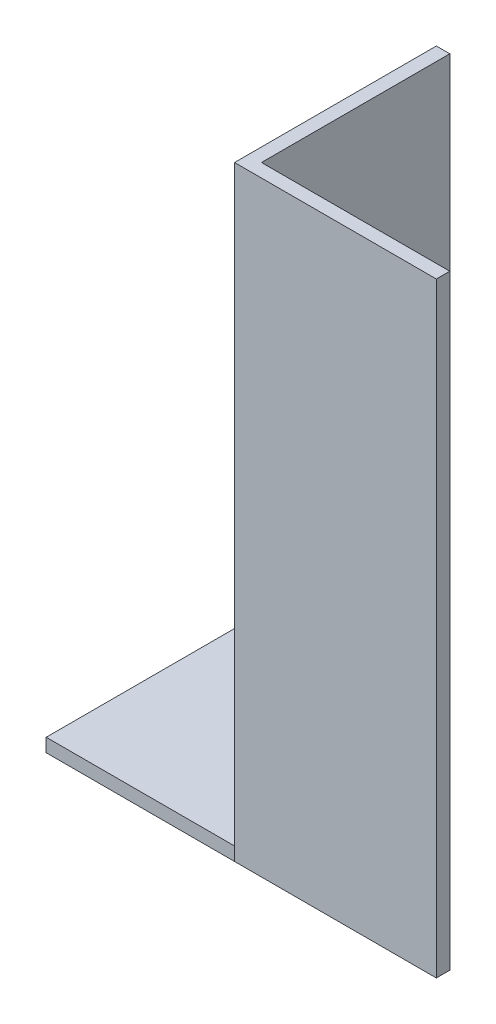
ISO-10303-21;
HEADER;
FILE_DESCRIPTION(('STEP AP214'),'2;1');
FILE_NAME('part.step','',(''),(''),'','','');
FILE_SCHEMA(('AUTOMOTIVE_DESIGN { 1 0 10303 214 1 1 1 1 }'));
ENDSEC;
DATA;
#1=APPLICATION_CONTEXT('core data for automotive mechanical design processes');
#2=APPLICATION_PROTOCOL_DEFINITION('international standard','automotive_design',2000,#1);
#3=PRODUCT_CONTEXT('',#1,'mechanical');
#4=PRODUCT('Part','Part','',(#3));
#5=PRODUCT_RELATED_PRODUCT_CATEGORY('part','',(#4));
#6=PRODUCT_DEFINITION_FORMATION('','',#4);
#7=PRODUCT_DEFINITION_CONTEXT('part definition',#1,'design');
#8=PRODUCT_DEFINITION('design','',#6,#7);
#9=PRODUCT_DEFINITION_SHAPE('','',#8);
#10=(LENGTH_UNIT() NAMED_UNIT(*) SI_UNIT(.MILLI.,.METRE.));
#11=(NAMED_UNIT(*) PLANE_ANGLE_UNIT() SI_UNIT($,.RADIAN.));
#12=(NAMED_UNIT(*) SI_UNIT($,.STERADIAN.) SOLID_ANGLE_UNIT());
#13=UNCERTAINTY_MEASURE_WITH_UNIT(LENGTH_MEASURE(1.E-05),#10,'distance_accuracy_value','');
#14=(GEOMETRIC_REPRESENTATION_CONTEXT(3) GLOBAL_UNCERTAINTY_ASSIGNED_CONTEXT((#13)) GLOBAL_UNIT_ASSIGNED_CONTEXT((#10,
#11,#12)) REPRESENTATION_CONTEXT('',''));
#15=CARTESIAN_POINT('',(0.,0.,0.));
#16=DIRECTION('',(0.,0.,1.));
#17=DIRECTION('',(1.,0.,0.));
#18=AXIS2_PLACEMENT_3D('',#15,#16,#17);
#19=CARTESIAN_POINT('',(15.,65.,0.));
#20=DIRECTION('',(0.,0.,-1.));
#21=DIRECTION('',(-1.,0.,0.));
#22=AXIS2_PLACEMENT_3D('',#19,#20,#21);
#23=PLANE('',#22);
#24=DIRECTION('',(-1.,0.,0.));
#25=VECTOR('',#24,1.);
#26=CARTESIAN_POINT('',(15.,20.,0.));
#27=LINE('',#26,#25);
#28=CARTESIAN_POINT('',(15.,20.,0.));
#29=VERTEX_POINT('',#28);
#30=CARTESIAN_POINT('',(0.,20.,0.));
#31=VERTEX_POINT('',#30);
#32=EDGE_CURVE('E105',#29,#31,#27,.T.);
#33=ORIENTED_EDGE('',*,*,#32,.F.);
#34=DIRECTION('',(0.,-1.,0.));
#35=VECTOR('',#34,1.);
#36=CARTESIAN_POINT('',(15.,65.,0.));
#37=LINE('',#36,#35);
#38=CARTESIAN_POINT('',(15.,65.,0.));
#39=VERTEX_POINT('',#38);
#40=EDGE_CURVE('E11',#39,#29,#37,.T.);
#41=ORIENTED_EDGE('',*,*,#40,.F.);
#42=DIRECTION('',(1.,0.,0.));
#43=VECTOR('',#42,1.);
#44=CARTESIAN_POINT('',(15.,65.,0.));
#45=LINE('',#44,#43);
#46=CARTESIAN_POINT('',(0.,65.,0.));
#47=VERTEX_POINT('',#46);
#48=EDGE_CURVE('E126',#47,#39,#45,.T.);
#49=ORIENTED_EDGE('',*,*,#48,.F.);
#50=DIRECTION('',(0.,-1.,0.));
#51=VECTOR('',#50,1.);
#52=CARTESIAN_POINT('',(0.,65.,0.));
#53=LINE('',#52,#51);
#54=EDGE_CURVE('E119',#47,#31,#53,.T.);
#55=ORIENTED_EDGE('',*,*,#54,.T.);
#56=EDGE_LOOP('',(#33,#41,#49,#55));
#57=FACE_BOUND('',#56,.T.);
#58=ADVANCED_FACE('F35',(#57),#23,.F.);
#59=CARTESIAN_POINT('',(15.,65.,-0.999999999999998));
#60=DIRECTION('',(-1.,0.,0.));
#61=DIRECTION('',(0.,0.,1.));
#62=AXIS2_PLACEMENT_3D('',#59,#60,#61);
#63=PLANE('',#62);
#64=DIRECTION('',(0.,0.,1.));
#65=VECTOR('',#64,1.);
#66=CARTESIAN_POINT('',(15.,20.,0.));
#67=LINE('',#66,#65);
#68=CARTESIAN_POINT('',(15.,20.,-0.999999999999993));
#69=VERTEX_POINT('',#68);
#70=EDGE_CURVE('E112',#69,#29,#67,.T.);
#71=ORIENTED_EDGE('',*,*,#70,.F.);
#72=DIRECTION('',(0.,-1.,0.));
#73=VECTOR('',#72,1.);
#74=CARTESIAN_POINT('',(15.,65.,-0.999999999999998));
#75=LINE('',#74,#73);
#76=CARTESIAN_POINT('',(15.,65.,-0.999999999999998));
#77=VERTEX_POINT('',#76);
#78=EDGE_CURVE('E42',#77,#69,#75,.T.);
#79=ORIENTED_EDGE('',*,*,#78,.F.);
#80=DIRECTION('',(0.,0.,-1.));
#81=VECTOR('',#80,1.);
#82=CARTESIAN_POINT('',(15.,65.,-0.999999999999998));
#83=LINE('',#82,#81);
#84=EDGE_CURVE('E147',#39,#77,#83,.T.);
#85=ORIENTED_EDGE('',*,*,#84,.F.);
#86=ORIENTED_EDGE('',*,*,#40,.T.);
#87=EDGE_LOOP('',(#71,#79,#85,#86));
#88=FACE_BOUND('',#87,.T.);
#89=ADVANCED_FACE('F146',(#88),#63,.F.);
#90=CARTESIAN_POINT('',(1.,65.,-0.999999999999997));
#91=DIRECTION('',(0.,0.,1.));
#92=DIRECTION('',(1.,0.,0.));
#93=AXIS2_PLACEMENT_3D('',#90,#91,#92);
#94=PLANE('',#93);
#95=DIRECTION('',(1.,0.,0.));
#96=VECTOR('',#95,1.);
#97=CARTESIAN_POINT('',(15.,20.,-0.999999999999993));
#98=LINE('',#97,#96);
#99=CARTESIAN_POINT('',(1.,20.,-0.999999999999996));
#100=VERTEX_POINT('',#99);
#101=EDGE_CURVE('E124',#100,#69,#98,.T.);
#102=ORIENTED_EDGE('',*,*,#101,.F.);
#103=DIRECTION('',(0.,-1.,0.));
#104=VECTOR('',#103,1.);
#105=CARTESIAN_POINT('',(1.,65.,-0.999999999999997));
#106=LINE('',#105,#104);
#107=CARTESIAN_POINT('',(1.,65.,-0.999999999999997));
#108=VERTEX_POINT('',#107);
#109=EDGE_CURVE('E135',#108,#100,#106,.T.);
#110=ORIENTED_EDGE('',*,*,#109,.F.);
#111=DIRECTION('',(-1.,0.,0.));
#112=VECTOR('',#111,1.);
#113=CARTESIAN_POINT('',(1.,65.,-0.999999999999997));
#114=LINE('',#113,#112);
#115=EDGE_CURVE('E144',#77,#108,#114,.T.);
#116=ORIENTED_EDGE('',*,*,#115,.F.);
#117=ORIENTED_EDGE('',*,*,#78,.T.);
#118=EDGE_LOOP('',(#102,#110,#116,#117));
#119=FACE_BOUND('',#118,.T.);
#120=ADVANCED_FACE('F142',(#119),#94,.F.);
#121=CARTESIAN_POINT('',(0.,65.,0.));
#122=DIRECTION('',(1.,0.,0.));
#123=DIRECTION('',(0.,0.,-1.));
#124=AXIS2_PLACEMENT_3D('',#121,#122,#123);
#125=PLANE('',#124);
#126=DIRECTION('',(0.,0.,-1.));
#127=VECTOR('',#126,1.);
#128=CARTESIAN_POINT('',(0.,20.,0.));
#129=LINE('',#128,#127);
#130=CARTESIAN_POINT('',(0.,20.,-0.999999999999996));
#131=VERTEX_POINT('',#130);
#132=EDGE_CURVE('E109',#31,#131,#129,.T.);
#133=ORIENTED_EDGE('',*,*,#132,.F.);
#134=ORIENTED_EDGE('',*,*,#54,.F.);
#135=DIRECTION('',(0.,0.,1.));
#136=VECTOR('',#135,1.);
#137=CARTESIAN_POINT('',(0.,65.,0.));
#138=LINE('',#137,#136);
#139=CARTESIAN_POINT('',(0.,65.,-15.));
#140=VERTEX_POINT('',#139);
#141=EDGE_CURVE('E49',#140,#47,#138,.T.);
#142=ORIENTED_EDGE('',*,*,#141,.F.);
#143=DIRECTION('',(0.,-1.,0.));
#144=VECTOR('',#143,1.);
#145=CARTESIAN_POINT('',(0.,65.,-15.));
#146=LINE('',#145,#144);
#147=CARTESIAN_POINT('',(0.,20.,-15.));
#148=VERTEX_POINT('',#147);
#149=EDGE_CURVE('E127',#140,#148,#146,.T.);
#150=ORIENTED_EDGE('',*,*,#149,.T.);
#151=DIRECTION('',(0.,0.,-1.));
#152=VECTOR('',#151,1.);
#153=CARTESIAN_POINT('',(0.,20.,-0.999999999999997));
#154=LINE('',#153,#152);
#155=EDGE_CURVE('E122',#131,#148,#154,.T.);
#156=ORIENTED_EDGE('',*,*,#155,.F.);
#157=EDGE_LOOP('',(#133,#134,#142,#150,#156));
#158=FACE_BOUND('',#157,.T.);
#159=ADVANCED_FACE('F118',(#158),#125,.F.);
#160=CARTESIAN_POINT('',(0.999999999999998,65.,-15.));
#161=DIRECTION('',(-1.,0.,0.));
#162=DIRECTION('',(0.,0.,1.));
#163=AXIS2_PLACEMENT_3D('',#160,#161,#162);
#164=PLANE('',#163);
#165=ORIENTED_EDGE('',*,*,#109,.T.);
#166=DIRECTION('',(0.,-1.,0.));
#167=VECTOR('',#166,1.);
#168=CARTESIAN_POINT('',(1.,65.,-0.999999999999985));
#169=LINE('',#168,#167);
#170=CARTESIAN_POINT('',(1.,19.,-0.999999999999996));
#171=VERTEX_POINT('',#170);
#172=EDGE_CURVE('E148',#100,#171,#169,.T.);
#173=ORIENTED_EDGE('',*,*,#172,.T.);
#174=DIRECTION('',(0.,0.,-1.));
#175=VECTOR('',#174,1.);
#176=CARTESIAN_POINT('',(1.,19.,-15.));
#177=LINE('',#176,#175);
#178=CARTESIAN_POINT('',(1.,19.,-15.));
#179=VERTEX_POINT('',#178);
#180=EDGE_CURVE('E152',#171,#179,#177,.T.);
#181=ORIENTED_EDGE('',*,*,#180,.T.);
#182=DIRECTION('',(0.,-1.,0.));
#183=VECTOR('',#182,1.);
#184=CARTESIAN_POINT('',(0.999999999999998,65.,-15.));
#185=LINE('',#184,#183);
#186=CARTESIAN_POINT('',(0.999999999999998,65.,-15.));
#187=VERTEX_POINT('',#186);
#188=EDGE_CURVE('E129',#187,#179,#185,.T.);
#189=ORIENTED_EDGE('',*,*,#188,.F.);
#190=DIRECTION('',(0.,0.,-1.));
#191=VECTOR('',#190,1.);
#192=CARTESIAN_POINT('',(0.999999999999998,65.,-15.));
#193=LINE('',#192,#191);
#194=EDGE_CURVE('E184',#108,#187,#193,.T.);
#195=ORIENTED_EDGE('',*,*,#194,.F.);
#196=EDGE_LOOP('',(#165,#173,#181,#189,#195));
#197=FACE_BOUND('',#196,.T.);
#198=ADVANCED_FACE('F189',(#197),#164,.F.);
#199=CARTESIAN_POINT('',(0.,65.,-15.));
#200=DIRECTION('',(0.,0.,1.));
#201=DIRECTION('',(1.,0.,0.));
#202=AXIS2_PLACEMENT_3D('',#199,#200,#201);
#203=PLANE('',#202);
#204=ORIENTED_EDGE('',*,*,#188,.T.);
#205=DIRECTION('',(1.,0.,0.));
#206=VECTOR('',#205,1.);
#207=CARTESIAN_POINT('',(-15.,19.,-15.));
#208=LINE('',#207,#206);
#209=CARTESIAN_POINT('',(-15.,19.,-15.));
#210=VERTEX_POINT('',#209);
#211=EDGE_CURVE('E171',#210,#179,#208,.T.);
#212=ORIENTED_EDGE('',*,*,#211,.F.);
#213=DIRECTION('',(0.,1.,0.));
#214=VECTOR('',#213,1.);
#215=CARTESIAN_POINT('',(-15.,20.,-15.));
#216=LINE('',#215,#214);
#217=CARTESIAN_POINT('',(-15.,20.,-15.));
#218=VERTEX_POINT('',#217);
#219=EDGE_CURVE('E156',#210,#218,#216,.T.);
#220=ORIENTED_EDGE('',*,*,#219,.T.);
#221=DIRECTION('',(1.,0.,0.));
#222=VECTOR('',#221,1.);
#223=CARTESIAN_POINT('',(-15.,20.,-15.));
#224=LINE('',#223,#222);
#225=EDGE_CURVE('E168',#218,#148,#224,.T.);
#226=ORIENTED_EDGE('',*,*,#225,.T.);
#227=ORIENTED_EDGE('',*,*,#149,.F.);
#228=DIRECTION('',(-1.,0.,0.));
#229=VECTOR('',#228,1.);
#230=CARTESIAN_POINT('',(0.,65.,-15.));
#231=LINE('',#230,#229);
#232=EDGE_CURVE('E54',#187,#140,#231,.T.);
#233=ORIENTED_EDGE('',*,*,#232,.F.);
#234=EDGE_LOOP('',(#204,#212,#220,#226,#227,#233));
#235=FACE_BOUND('',#234,.T.);
#236=ADVANCED_FACE('F192',(#235),#203,.F.);
#237=CARTESIAN_POINT('',(0.,65.,0.));
#238=DIRECTION('',(0.,-1.,0.));
#239=DIRECTION('',(0.,0.,-1.));
#240=AXIS2_PLACEMENT_3D('',#237,#238,#239);
#241=PLANE('',#240);
#242=ORIENTED_EDGE('',*,*,#48,.T.);
#243=ORIENTED_EDGE('',*,*,#84,.T.);
#244=ORIENTED_EDGE('',*,*,#115,.T.);
#245=ORIENTED_EDGE('',*,*,#194,.T.);
#246=ORIENTED_EDGE('',*,*,#232,.T.);
#247=ORIENTED_EDGE('',*,*,#141,.T.);
#248=EDGE_LOOP('',(#242,#243,#244,#245,#246,#247));
#249=FACE_BOUND('',#248,.T.);
#250=ADVANCED_FACE('F187',(#249),#241,.F.);
#251=CARTESIAN_POINT('',(-15.,20.,-15.));
#252=DIRECTION('',(0.,1.,0.));
#253=DIRECTION('',(0.,0.,1.));
#254=AXIS2_PLACEMENT_3D('',#251,#252,#253);
#255=PLANE('',#254);
#256=ORIENTED_EDGE('',*,*,#155,.T.);
#257=ORIENTED_EDGE('',*,*,#225,.F.);
#258=DIRECTION('',(0.,0.,1.));
#259=VECTOR('',#258,1.);
#260=CARTESIAN_POINT('',(-15.,20.,-15.));
#261=LINE('',#260,#259);
#262=CARTESIAN_POINT('',(-15.,20.,-0.999999999999998));
#263=VERTEX_POINT('',#262);
#264=EDGE_CURVE('E159',#218,#263,#261,.T.);
#265=ORIENTED_EDGE('',*,*,#264,.T.);
#266=DIRECTION('',(1.,0.,0.));
#267=VECTOR('',#266,1.);
#268=CARTESIAN_POINT('',(-15.,20.,-0.999999999999998));
#269=LINE('',#268,#267);
#270=EDGE_CURVE('E176',#263,#131,#269,.T.);
#271=ORIENTED_EDGE('',*,*,#270,.T.);
#272=EDGE_LOOP('',(#256,#257,#265,#271));
#273=FACE_BOUND('',#272,.T.);
#274=ADVANCED_FACE('F194',(#273),#255,.T.);
#275=CARTESIAN_POINT('',(-15.,20.,-0.999999999999998));
#276=DIRECTION('',(0.,0.,1.));
#277=DIRECTION('',(0.,-1.,0.));
#278=AXIS2_PLACEMENT_3D('',#275,#276,#277);
#279=PLANE('',#278);
#280=DIRECTION('',(1.,0.,0.));
#281=VECTOR('',#280,1.);
#282=CARTESIAN_POINT('',(-15.,19.,-0.999999999999998));
#283=LINE('',#282,#281);
#284=CARTESIAN_POINT('',(-15.,19.,-0.999999999999998));
#285=VERTEX_POINT('',#284);
#286=EDGE_CURVE('E174',#285,#171,#283,.T.);
#287=ORIENTED_EDGE('',*,*,#286,.T.);
#288=ORIENTED_EDGE('',*,*,#172,.F.);
#289=EDGE_CURVE('E149',#131,#100,#98,.T.);
#290=ORIENTED_EDGE('',*,*,#289,.F.);
#291=ORIENTED_EDGE('',*,*,#270,.F.);
#292=DIRECTION('',(0.,-1.,0.));
#293=VECTOR('',#292,1.);
#294=CARTESIAN_POINT('',(-15.,20.,-0.999999999999998));
#295=LINE('',#294,#293);
#296=EDGE_CURVE('E162',#263,#285,#295,.T.);
#297=ORIENTED_EDGE('',*,*,#296,.T.);
#298=EDGE_LOOP('',(#287,#288,#290,#291,#297));
#299=FACE_BOUND('',#298,.T.);
#300=ADVANCED_FACE('F198',(#299),#279,.T.);
#301=CARTESIAN_POINT('',(-15.,19.,-15.));
#302=DIRECTION('',(0.,-1.,0.));
#303=DIRECTION('',(0.,0.,-1.));
#304=AXIS2_PLACEMENT_3D('',#301,#302,#303);
#305=PLANE('',#304);
#306=ORIENTED_EDGE('',*,*,#180,.F.);
#307=ORIENTED_EDGE('',*,*,#286,.F.);
#308=DIRECTION('',(0.,0.,-1.));
#309=VECTOR('',#308,1.);
#310=CARTESIAN_POINT('',(-15.,19.,-15.));
#311=LINE('',#310,#309);
#312=EDGE_CURVE('E165',#285,#210,#311,.T.);
#313=ORIENTED_EDGE('',*,*,#312,.T.);
#314=ORIENTED_EDGE('',*,*,#211,.T.);
#315=EDGE_LOOP('',(#306,#307,#313,#314));
#316=FACE_BOUND('',#315,.T.);
#317=ADVANCED_FACE('F204',(#316),#305,.T.);
#318=CARTESIAN_POINT('',(-15.,0.,0.));
#319=DIRECTION('',(-1.,0.,0.));
#320=DIRECTION('',(0.,0.,1.));
#321=AXIS2_PLACEMENT_3D('',#318,#319,#320);
#322=PLANE('',#321);
#323=ORIENTED_EDGE('',*,*,#219,.F.);
#324=ORIENTED_EDGE('',*,*,#312,.F.);
#325=ORIENTED_EDGE('',*,*,#296,.F.);
#326=ORIENTED_EDGE('',*,*,#264,.F.);
#327=EDGE_LOOP('',(#323,#324,#325,#326));
#328=FACE_BOUND('',#327,.T.);
#329=ADVANCED_FACE('F202',(#328),#322,.T.);
#330=CARTESIAN_POINT('',(0.,20.,0.));
#331=DIRECTION('',(0.,-1.,0.));
#332=DIRECTION('',(0.,0.,-1.));
#333=AXIS2_PLACEMENT_3D('',#330,#331,#332);
#334=PLANE('',#333);
#335=ORIENTED_EDGE('',*,*,#32,.T.);
#336=ORIENTED_EDGE('',*,*,#132,.T.);
#337=ORIENTED_EDGE('',*,*,#289,.T.);
#338=ORIENTED_EDGE('',*,*,#101,.T.);
#339=ORIENTED_EDGE('',*,*,#70,.T.);
#340=EDGE_LOOP('',(#335,#336,#337,#338,#339));
#341=FACE_BOUND('',#340,.T.);
#342=ADVANCED_FACE('F107',(#341),#334,.T.);
#343=CLOSED_SHELL('',(#58,#89,#120,#159,#198,#236,#250,#274,#300,#317,#329,#342));
#344=MANIFOLD_SOLID_BREP('B2',#343);
#345=ADVANCED_BREP_SHAPE_REPRESENTATION('',(#18,#344),#14);
#346=SHAPE_DEFINITION_REPRESENTATION(#9,#345);
ENDSEC;
END-ISO-10303-21;
